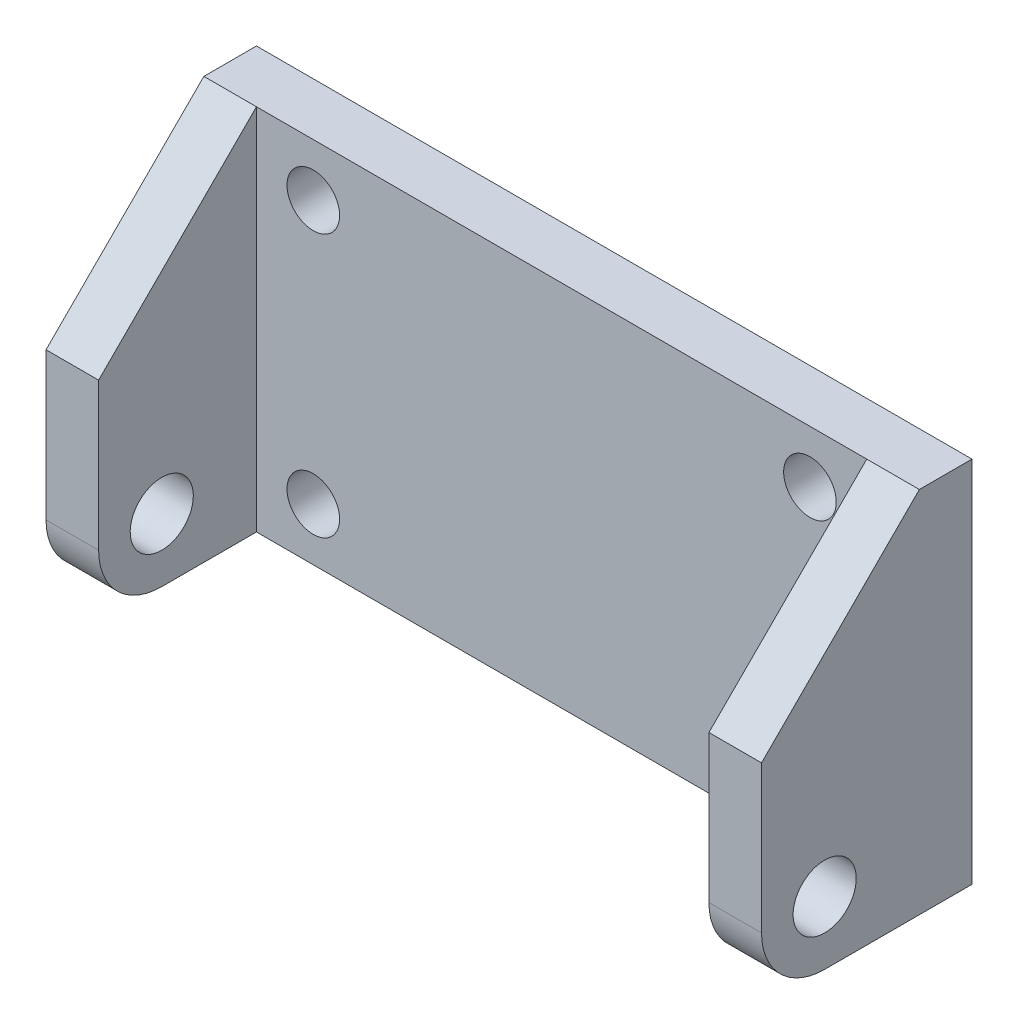
ISO-10303-21;
HEADER;
FILE_DESCRIPTION(('STEP AP214'),'2;1');
FILE_NAME('part.step','',(''),(''),'','','');
FILE_SCHEMA(('AUTOMOTIVE_DESIGN { 1 0 10303 214 1 1 1 1 }'));
ENDSEC;
DATA;
#1=APPLICATION_CONTEXT('core data for automotive mechanical design processes');
#2=APPLICATION_PROTOCOL_DEFINITION('international standard','automotive_design',2000,#1);
#3=PRODUCT_CONTEXT('',#1,'mechanical');
#4=PRODUCT('Part','Part','',(#3));
#5=PRODUCT_RELATED_PRODUCT_CATEGORY('part','',(#4));
#6=PRODUCT_DEFINITION_FORMATION('','',#4);
#7=PRODUCT_DEFINITION_CONTEXT('part definition',#1,'design');
#8=PRODUCT_DEFINITION('design','',#6,#7);
#9=PRODUCT_DEFINITION_SHAPE('','',#8);
#10=(LENGTH_UNIT() NAMED_UNIT(*) SI_UNIT(.MILLI.,.METRE.));
#11=(NAMED_UNIT(*) PLANE_ANGLE_UNIT() SI_UNIT($,.RADIAN.));
#12=(NAMED_UNIT(*) SI_UNIT($,.STERADIAN.) SOLID_ANGLE_UNIT());
#13=UNCERTAINTY_MEASURE_WITH_UNIT(LENGTH_MEASURE(1.E-05),#10,'distance_accuracy_value','');
#14=(GEOMETRIC_REPRESENTATION_CONTEXT(3) GLOBAL_UNCERTAINTY_ASSIGNED_CONTEXT((#13)) GLOBAL_UNIT_ASSIGNED_CONTEXT((#10,
#11,#12)) REPRESENTATION_CONTEXT('',''));
#15=CARTESIAN_POINT('',(0.,0.,0.));
#16=DIRECTION('',(0.,0.,1.));
#17=DIRECTION('',(1.,0.,0.));
#18=AXIS2_PLACEMENT_3D('',#15,#16,#17);
#19=CARTESIAN_POINT('',(0.,0.,2.5));
#20=DIRECTION('',(0.,0.,1.));
#21=DIRECTION('',(1.,0.,0.));
#22=AXIS2_PLACEMENT_3D('',#19,#20,#21);
#23=PLANE('',#22);
#24=CARTESIAN_POINT('',(12.4214285714285,10.3871428571429,2.5));
#25=DIRECTION('',(0.,0.,1.));
#26=DIRECTION('',(1.,0.,0.));
#27=AXIS2_PLACEMENT_3D('',#24,#25,#26);
#28=CIRCLE('',#27,1.25);
#29=CARTESIAN_POINT('',(13.6714285714285,10.3871428571429,2.5));
#30=VERTEX_POINT('',#29);
#31=EDGE_CURVE('E208',#30,#30,#28,.T.);
#32=ORIENTED_EDGE('',*,*,#31,.F.);
#33=EDGE_LOOP('',(#32));
#34=FACE_BOUND('',#33,.T.);
#35=CARTESIAN_POINT('',(-11.1785714285714,-2.11285714285714,2.5));
#36=DIRECTION('',(0.,0.,1.));
#37=DIRECTION('',(1.,0.,0.));
#38=AXIS2_PLACEMENT_3D('',#35,#36,#37);
#39=CIRCLE('',#38,1.25);
#40=CARTESIAN_POINT('',(-9.92857142857143,-2.11285714285714,2.5));
#41=VERTEX_POINT('',#40);
#42=EDGE_CURVE('E220',#41,#41,#39,.T.);
#43=ORIENTED_EDGE('',*,*,#42,.F.);
#44=EDGE_LOOP('',(#43));
#45=FACE_BOUND('',#44,.T.);
#46=CARTESIAN_POINT('',(12.4214285714286,-2.11285714285714,2.5));
#47=DIRECTION('',(0.,0.,1.));
#48=DIRECTION('',(1.,0.,0.));
#49=AXIS2_PLACEMENT_3D('',#46,#47,#48);
#50=CIRCLE('',#49,1.25);
#51=CARTESIAN_POINT('',(13.6714285714286,-2.11285714285714,2.5));
#52=VERTEX_POINT('',#51);
#53=EDGE_CURVE('E214',#52,#52,#50,.T.);
#54=ORIENTED_EDGE('',*,*,#53,.F.);
#55=EDGE_LOOP('',(#54));
#56=FACE_BOUND('',#55,.T.);
#57=CARTESIAN_POINT('',(-11.1785714285715,10.3871428571429,2.5));
#58=DIRECTION('',(0.,0.,1.));
#59=DIRECTION('',(1.,0.,0.));
#60=AXIS2_PLACEMENT_3D('',#57,#58,#59);
#61=CIRCLE('',#60,1.25);
#62=CARTESIAN_POINT('',(-9.92857142857147,10.3871428571429,2.5));
#63=VERTEX_POINT('',#62);
#64=EDGE_CURVE('E202',#63,#63,#61,.T.);
#65=ORIENTED_EDGE('',*,*,#64,.F.);
#66=EDGE_LOOP('',(#65));
#67=FACE_BOUND('',#66,.T.);
#68=DIRECTION('',(1.,0.,0.));
#69=VECTOR('',#68,1.);
#70=CARTESIAN_POINT('',(-16.3785714285714,-4.61285714285714,2.5));
#71=LINE('',#70,#69);
#72=CARTESIAN_POINT('',(-13.8785714285714,-4.61285714285714,2.5));
#73=VERTEX_POINT('',#72);
#74=CARTESIAN_POINT('',(15.1214285714286,-4.61285714285714,2.5));
#75=VERTEX_POINT('',#74);
#76=EDGE_CURVE('E144',#73,#75,#71,.T.);
#77=ORIENTED_EDGE('',*,*,#76,.T.);
#78=DIRECTION('',(0.,-1.,0.));
#79=VECTOR('',#78,1.);
#80=CARTESIAN_POINT('',(15.1214285714286,-4.61285714285714,2.5));
#81=LINE('',#80,#79);
#82=CARTESIAN_POINT('',(15.1214285714286,12.8871428571429,2.5));
#83=VERTEX_POINT('',#82);
#84=EDGE_CURVE('E122',#83,#75,#81,.T.);
#85=ORIENTED_EDGE('',*,*,#84,.F.);
#86=DIRECTION('',(-1.,0.,0.));
#87=VECTOR('',#86,1.);
#88=CARTESIAN_POINT('',(-16.3785714285714,12.8871428571429,2.5));
#89=LINE('',#88,#87);
#90=CARTESIAN_POINT('',(-13.8785714285714,12.8871428571429,2.5));
#91=VERTEX_POINT('',#90);
#92=EDGE_CURVE('E134',#83,#91,#89,.T.);
#93=ORIENTED_EDGE('',*,*,#92,.T.);
#94=DIRECTION('',(0.,1.,0.));
#95=VECTOR('',#94,1.);
#96=CARTESIAN_POINT('',(-13.8785714285714,-4.61285714285714,2.5));
#97=LINE('',#96,#95);
#98=EDGE_CURVE('E195',#73,#91,#97,.T.);
#99=ORIENTED_EDGE('',*,*,#98,.F.);
#100=EDGE_LOOP('',(#77,#85,#93,#99));
#101=FACE_BOUND('',#100,.T.);
#102=ADVANCED_FACE('F33',(#34,#45,#56,#67,#101),#23,.T.);
#103=CARTESIAN_POINT('',(0.,0.,0.));
#104=DIRECTION('',(0.,0.,1.));
#105=DIRECTION('',(1.,0.,0.));
#106=AXIS2_PLACEMENT_3D('',#103,#104,#105);
#107=PLANE('',#106);
#108=DIRECTION('',(0.,-1.,0.));
#109=VECTOR('',#108,1.);
#110=CARTESIAN_POINT('',(-16.3785714285714,12.8871428571429,0.));
#111=LINE('',#110,#109);
#112=CARTESIAN_POINT('',(-16.3785714285714,12.8871428571429,0.));
#113=VERTEX_POINT('',#112);
#114=CARTESIAN_POINT('',(-16.3785714285714,-4.61285714285714,0.));
#115=VERTEX_POINT('',#114);
#116=EDGE_CURVE('E223',#113,#115,#111,.T.);
#117=ORIENTED_EDGE('',*,*,#116,.F.);
#118=DIRECTION('',(-1.,0.,0.));
#119=VECTOR('',#118,1.);
#120=CARTESIAN_POINT('',(-16.3785714285714,12.8871428571429,0.));
#121=LINE('',#120,#119);
#122=CARTESIAN_POINT('',(17.6214285714286,12.8871428571429,0.));
#123=VERTEX_POINT('',#122);
#124=EDGE_CURVE('E226',#123,#113,#121,.T.);
#125=ORIENTED_EDGE('',*,*,#124,.F.);
#126=DIRECTION('',(0.,1.,0.));
#127=VECTOR('',#126,1.);
#128=CARTESIAN_POINT('',(17.6214285714286,12.8871428571429,0.));
#129=LINE('',#128,#127);
#130=CARTESIAN_POINT('',(17.6214285714286,-4.61285714285714,0.));
#131=VERTEX_POINT('',#130);
#132=EDGE_CURVE('E233',#131,#123,#129,.T.);
#133=ORIENTED_EDGE('',*,*,#132,.F.);
#134=DIRECTION('',(1.,0.,0.));
#135=VECTOR('',#134,1.);
#136=CARTESIAN_POINT('',(-16.3785714285714,-4.61285714285714,0.));
#137=LINE('',#136,#135);
#138=EDGE_CURVE('E230',#115,#131,#137,.T.);
#139=ORIENTED_EDGE('',*,*,#138,.F.);
#140=EDGE_LOOP('',(#117,#125,#133,#139));
#141=FACE_BOUND('',#140,.T.);
#142=CARTESIAN_POINT('',(-11.1785714285714,-2.11285714285714,0.));
#143=DIRECTION('',(0.,0.,1.));
#144=DIRECTION('',(1.,0.,0.));
#145=AXIS2_PLACEMENT_3D('',#142,#143,#144);
#146=CIRCLE('',#145,1.25);
#147=CARTESIAN_POINT('',(-9.92857142857143,-2.11285714285714,0.));
#148=VERTEX_POINT('',#147);
#149=EDGE_CURVE('E217',#148,#148,#146,.T.);
#150=ORIENTED_EDGE('',*,*,#149,.T.);
#151=EDGE_LOOP('',(#150));
#152=FACE_BOUND('',#151,.T.);
#153=CARTESIAN_POINT('',(12.4214285714286,-2.11285714285714,0.));
#154=DIRECTION('',(0.,0.,1.));
#155=DIRECTION('',(1.,0.,0.));
#156=AXIS2_PLACEMENT_3D('',#153,#154,#155);
#157=CIRCLE('',#156,1.25);
#158=CARTESIAN_POINT('',(13.6714285714286,-2.11285714285714,0.));
#159=VERTEX_POINT('',#158);
#160=EDGE_CURVE('E211',#159,#159,#157,.T.);
#161=ORIENTED_EDGE('',*,*,#160,.T.);
#162=EDGE_LOOP('',(#161));
#163=FACE_BOUND('',#162,.T.);
#164=CARTESIAN_POINT('',(12.4214285714285,10.3871428571429,0.));
#165=DIRECTION('',(0.,0.,1.));
#166=DIRECTION('',(1.,0.,0.));
#167=AXIS2_PLACEMENT_3D('',#164,#165,#166);
#168=CIRCLE('',#167,1.25);
#169=CARTESIAN_POINT('',(13.6714285714285,10.3871428571429,0.));
#170=VERTEX_POINT('',#169);
#171=EDGE_CURVE('E205',#170,#170,#168,.T.);
#172=ORIENTED_EDGE('',*,*,#171,.T.);
#173=EDGE_LOOP('',(#172));
#174=FACE_BOUND('',#173,.T.);
#175=CARTESIAN_POINT('',(-11.1785714285715,10.3871428571429,0.));
#176=DIRECTION('',(0.,0.,1.));
#177=DIRECTION('',(1.,0.,0.));
#178=AXIS2_PLACEMENT_3D('',#175,#176,#177);
#179=CIRCLE('',#178,1.25);
#180=CARTESIAN_POINT('',(-9.92857142857147,10.3871428571429,0.));
#181=VERTEX_POINT('',#180);
#182=EDGE_CURVE('E189',#181,#181,#179,.T.);
#183=ORIENTED_EDGE('',*,*,#182,.T.);
#184=EDGE_LOOP('',(#183));
#185=FACE_BOUND('',#184,.T.);
#186=ADVANCED_FACE('F257',(#141,#152,#163,#174,#185),#107,.F.);
#187=CARTESIAN_POINT('',(-16.3785714285714,12.8871428571429,2.5));
#188=DIRECTION('',(1.,0.,0.));
#189=DIRECTION('',(0.,1.,0.));
#190=AXIS2_PLACEMENT_3D('',#187,#188,#189);
#191=PLANE('',#190);
#192=CARTESIAN_POINT('',(-16.3785714285714,-1.61285714285714,7.));
#193=DIRECTION('',(1.,0.,0.));
#194=DIRECTION('',(0.,0.,-1.));
#195=AXIS2_PLACEMENT_3D('',#192,#193,#194);
#196=CIRCLE('',#195,1.5);
#197=CARTESIAN_POINT('',(-16.3785714285714,-1.61285714285714,5.5));
#198=VERTEX_POINT('',#197);
#199=EDGE_CURVE('E298',#198,#198,#196,.T.);
#200=ORIENTED_EDGE('',*,*,#199,.T.);
#201=EDGE_LOOP('',(#200));
#202=FACE_BOUND('',#201,.T.);
#203=DIRECTION('',(0.,0.,-1.));
#204=VECTOR('',#203,1.);
#205=CARTESIAN_POINT('',(-16.3785714285714,-4.61285714285714,2.5));
#206=LINE('',#205,#204);
#207=CARTESIAN_POINT('',(-16.3785714285714,-4.61285714285714,7.));
#208=VERTEX_POINT('',#207);
#209=EDGE_CURVE('E243',#208,#115,#206,.T.);
#210=ORIENTED_EDGE('',*,*,#209,.F.);
#211=CARTESIAN_POINT('',(-16.3785714285714,-1.61285714285714,7.));
#212=DIRECTION('',(1.,0.,0.));
#213=DIRECTION('',(0.,1.,0.));
#214=AXIS2_PLACEMENT_3D('',#211,#212,#213);
#215=CIRCLE('',#214,3.);
#216=CARTESIAN_POINT('',(-16.3785714285714,-1.61285714285714,10.));
#217=VERTEX_POINT('',#216);
#218=EDGE_CURVE('E11',#208,#217,#215,.F.);
#219=ORIENTED_EDGE('',*,*,#218,.T.);
#220=DIRECTION('',(0.,-1.,0.));
#221=VECTOR('',#220,1.);
#222=CARTESIAN_POINT('',(-16.3785714285714,-4.61285714285714,10.));
#223=LINE('',#222,#221);
#224=CARTESIAN_POINT('',(-16.3785714285714,5.38714285714287,10.));
#225=VERTEX_POINT('',#224);
#226=EDGE_CURVE('E193',#225,#217,#223,.T.);
#227=ORIENTED_EDGE('',*,*,#226,.F.);
#228=DIRECTION('',(0.,-0.707106781186546,0.707106781186549));
#229=VECTOR('',#228,1.);
#230=CARTESIAN_POINT('',(-16.3785714285714,5.38714285714287,10.));
#231=LINE('',#230,#229);
#232=CARTESIAN_POINT('',(-16.3785714285714,12.8871428571429,2.49999999999998));
#233=VERTEX_POINT('',#232);
#234=EDGE_CURVE('E162',#225,#233,#231,.F.);
#235=ORIENTED_EDGE('',*,*,#234,.T.);
#236=DIRECTION('',(0.,0.,-1.));
#237=VECTOR('',#236,1.);
#238=CARTESIAN_POINT('',(-16.3785714285714,12.8871428571429,2.5));
#239=LINE('',#238,#237);
#240=EDGE_CURVE('E143',#233,#113,#239,.T.);
#241=ORIENTED_EDGE('',*,*,#240,.T.);
#242=ORIENTED_EDGE('',*,*,#116,.T.);
#243=EDGE_LOOP('',(#210,#219,#227,#235,#241,#242));
#244=FACE_BOUND('',#243,.T.);
#245=ADVANCED_FACE('F259',(#202,#244),#191,.F.);
#246=CARTESIAN_POINT('',(-16.3785714285714,-4.61285714285714,2.5));
#247=DIRECTION('',(0.,1.,0.));
#248=DIRECTION('',(0.,0.,1.));
#249=AXIS2_PLACEMENT_3D('',#246,#247,#248);
#250=PLANE('',#249);
#251=DIRECTION('',(0.,0.,-1.));
#252=VECTOR('',#251,1.);
#253=CARTESIAN_POINT('',(17.6214285714286,-4.61285714285714,2.5));
#254=LINE('',#253,#252);
#255=CARTESIAN_POINT('',(17.6214285714286,-4.61285714285714,7.));
#256=VERTEX_POINT('',#255);
#257=EDGE_CURVE('E241',#256,#131,#254,.T.);
#258=ORIENTED_EDGE('',*,*,#257,.F.);
#259=DIRECTION('',(1.,0.,0.));
#260=VECTOR('',#259,1.);
#261=CARTESIAN_POINT('',(15.1214285714286,-4.61285714285714,7.));
#262=LINE('',#261,#260);
#263=CARTESIAN_POINT('',(15.1214285714286,-4.61285714285714,7.));
#264=VERTEX_POINT('',#263);
#265=EDGE_CURVE('E174',#256,#264,#262,.F.);
#266=ORIENTED_EDGE('',*,*,#265,.T.);
#267=DIRECTION('',(0.,0.,-1.));
#268=VECTOR('',#267,1.);
#269=CARTESIAN_POINT('',(15.1214285714286,-4.61285714285714,10.));
#270=LINE('',#269,#268);
#271=EDGE_CURVE('E198',#264,#75,#270,.T.);
#272=ORIENTED_EDGE('',*,*,#271,.T.);
#273=ORIENTED_EDGE('',*,*,#76,.F.);
#274=DIRECTION('',(0.,0.,-1.));
#275=VECTOR('',#274,1.);
#276=CARTESIAN_POINT('',(-13.8785714285714,-4.61285714285714,10.));
#277=LINE('',#276,#275);
#278=CARTESIAN_POINT('',(-13.8785714285714,-4.61285714285714,7.));
#279=VERTEX_POINT('',#278);
#280=EDGE_CURVE('E184',#279,#73,#277,.T.);
#281=ORIENTED_EDGE('',*,*,#280,.F.);
#282=DIRECTION('',(1.,0.,0.));
#283=VECTOR('',#282,1.);
#284=CARTESIAN_POINT('',(-16.3785714285714,-4.61285714285714,7.));
#285=LINE('',#284,#283);
#286=EDGE_CURVE('E172',#279,#208,#285,.F.);
#287=ORIENTED_EDGE('',*,*,#286,.T.);
#288=ORIENTED_EDGE('',*,*,#209,.T.);
#289=ORIENTED_EDGE('',*,*,#138,.T.);
#290=EDGE_LOOP('',(#258,#266,#272,#273,#281,#287,#288,#289));
#291=FACE_BOUND('',#290,.T.);
#292=ADVANCED_FACE('F188',(#291),#250,.F.);
#293=CARTESIAN_POINT('',(17.6214285714286,12.8871428571429,2.5));
#294=DIRECTION('',(-1.,0.,0.));
#295=DIRECTION('',(0.,-1.,0.));
#296=AXIS2_PLACEMENT_3D('',#293,#294,#295);
#297=PLANE('',#296);
#298=CARTESIAN_POINT('',(17.6214285714286,-1.61285714285714,7.));
#299=DIRECTION('',(1.,0.,0.));
#300=DIRECTION('',(0.,0.,-1.));
#301=AXIS2_PLACEMENT_3D('',#298,#299,#300);
#302=CIRCLE('',#301,1.5);
#303=CARTESIAN_POINT('',(17.6214285714286,-1.61285714285714,5.5));
#304=VERTEX_POINT('',#303);
#305=EDGE_CURVE('E300',#304,#304,#302,.T.);
#306=ORIENTED_EDGE('',*,*,#305,.F.);
#307=EDGE_LOOP('',(#306));
#308=FACE_BOUND('',#307,.T.);
#309=DIRECTION('',(0.,1.,0.));
#310=VECTOR('',#309,1.);
#311=CARTESIAN_POINT('',(17.6214285714286,-4.61285714285714,10.));
#312=LINE('',#311,#310);
#313=CARTESIAN_POINT('',(17.6214285714286,-1.61285714285714,10.));
#314=VERTEX_POINT('',#313);
#315=CARTESIAN_POINT('',(17.6214285714286,5.38714285714287,10.));
#316=VERTEX_POINT('',#315);
#317=EDGE_CURVE('E148',#314,#316,#312,.T.);
#318=ORIENTED_EDGE('',*,*,#317,.F.);
#319=CARTESIAN_POINT('',(17.6214285714286,-1.61285714285714,7.));
#320=DIRECTION('',(-1.,0.,0.));
#321=DIRECTION('',(0.,-1.,0.));
#322=AXIS2_PLACEMENT_3D('',#319,#320,#321);
#323=CIRCLE('',#322,3.);
#324=EDGE_CURVE('E170',#314,#256,#323,.F.);
#325=ORIENTED_EDGE('',*,*,#324,.T.);
#326=ORIENTED_EDGE('',*,*,#257,.T.);
#327=ORIENTED_EDGE('',*,*,#132,.T.);
#328=DIRECTION('',(0.,0.,-1.));
#329=VECTOR('',#328,1.);
#330=CARTESIAN_POINT('',(17.6214285714286,12.8871428571429,2.5));
#331=LINE('',#330,#329);
#332=CARTESIAN_POINT('',(17.6214285714286,12.8871428571429,2.49999999999998));
#333=VERTEX_POINT('',#332);
#334=EDGE_CURVE('E239',#333,#123,#331,.T.);
#335=ORIENTED_EDGE('',*,*,#334,.F.);
#336=DIRECTION('',(0.,-0.707106781186546,0.707106781186549));
#337=VECTOR('',#336,1.);
#338=CARTESIAN_POINT('',(17.6214285714286,5.38714285714287,10.));
#339=LINE('',#338,#337);
#340=EDGE_CURVE('E154',#333,#316,#339,.T.);
#341=ORIENTED_EDGE('',*,*,#340,.T.);
#342=EDGE_LOOP('',(#318,#325,#326,#327,#335,#341));
#343=FACE_BOUND('',#342,.T.);
#344=ADVANCED_FACE('F251',(#308,#343),#297,.F.);
#345=CARTESIAN_POINT('',(-16.3785714285714,12.8871428571429,2.5));
#346=DIRECTION('',(0.,-1.,0.));
#347=DIRECTION('',(0.,0.,-1.));
#348=AXIS2_PLACEMENT_3D('',#345,#346,#347);
#349=PLANE('',#348);
#350=ORIENTED_EDGE('',*,*,#92,.F.);
#351=DIRECTION('',(1.,0.,0.));
#352=VECTOR('',#351,1.);
#353=CARTESIAN_POINT('',(17.6214285714286,12.8871428571429,2.49999999999998));
#354=LINE('',#353,#352);
#355=EDGE_CURVE('E136',#83,#333,#354,.T.);
#356=ORIENTED_EDGE('',*,*,#355,.T.);
#357=ORIENTED_EDGE('',*,*,#334,.T.);
#358=ORIENTED_EDGE('',*,*,#124,.T.);
#359=ORIENTED_EDGE('',*,*,#240,.F.);
#360=DIRECTION('',(1.,0.,0.));
#361=VECTOR('',#360,1.);
#362=CARTESIAN_POINT('',(-16.3785714285714,12.8871428571429,2.49999999999998));
#363=LINE('',#362,#361);
#364=EDGE_CURVE('E129',#233,#91,#363,.T.);
#365=ORIENTED_EDGE('',*,*,#364,.T.);
#366=EDGE_LOOP('',(#350,#356,#357,#358,#359,#365));
#367=FACE_BOUND('',#366,.T.);
#368=ADVANCED_FACE('F135',(#367),#349,.F.);
#369=CARTESIAN_POINT('',(-11.1785714285714,-2.11285714285714,2.5));
#370=DIRECTION('',(0.,0.,-1.));
#371=DIRECTION('',(-1.,0.,0.));
#372=AXIS2_PLACEMENT_3D('',#369,#370,#371);
#373=CYLINDRICAL_SURFACE('',#372,1.25);
#374=ORIENTED_EDGE('',*,*,#42,.T.);
#375=EDGE_LOOP('',(#374));
#376=FACE_BOUND('',#375,.T.);
#377=ORIENTED_EDGE('',*,*,#149,.F.);
#378=EDGE_LOOP('',(#377));
#379=FACE_BOUND('',#378,.T.);
#380=ADVANCED_FACE('F282',(#376,#379),#373,.F.);
#381=CARTESIAN_POINT('',(12.4214285714286,-2.11285714285714,2.5));
#382=DIRECTION('',(0.,0.,-1.));
#383=DIRECTION('',(-1.,0.,0.));
#384=AXIS2_PLACEMENT_3D('',#381,#382,#383);
#385=CYLINDRICAL_SURFACE('',#384,1.25);
#386=ORIENTED_EDGE('',*,*,#53,.T.);
#387=EDGE_LOOP('',(#386));
#388=FACE_BOUND('',#387,.T.);
#389=ORIENTED_EDGE('',*,*,#160,.F.);
#390=EDGE_LOOP('',(#389));
#391=FACE_BOUND('',#390,.T.);
#392=ADVANCED_FACE('F337',(#388,#391),#385,.F.);
#393=CARTESIAN_POINT('',(12.4214285714285,10.3871428571429,2.5));
#394=DIRECTION('',(0.,0.,-1.));
#395=DIRECTION('',(-1.,0.,0.));
#396=AXIS2_PLACEMENT_3D('',#393,#394,#395);
#397=CYLINDRICAL_SURFACE('',#396,1.25);
#398=ORIENTED_EDGE('',*,*,#31,.T.);
#399=EDGE_LOOP('',(#398));
#400=FACE_BOUND('',#399,.T.);
#401=ORIENTED_EDGE('',*,*,#171,.F.);
#402=EDGE_LOOP('',(#401));
#403=FACE_BOUND('',#402,.T.);
#404=ADVANCED_FACE('F334',(#400,#403),#397,.F.);
#405=CARTESIAN_POINT('',(-11.1785714285715,10.3871428571429,2.5));
#406=DIRECTION('',(0.,0.,-1.));
#407=DIRECTION('',(-1.,0.,0.));
#408=AXIS2_PLACEMENT_3D('',#405,#406,#407);
#409=CYLINDRICAL_SURFACE('',#408,1.25);
#410=ORIENTED_EDGE('',*,*,#64,.T.);
#411=EDGE_LOOP('',(#410));
#412=FACE_BOUND('',#411,.T.);
#413=ORIENTED_EDGE('',*,*,#182,.F.);
#414=EDGE_LOOP('',(#413));
#415=FACE_BOUND('',#414,.T.);
#416=ADVANCED_FACE('F331',(#412,#415),#409,.F.);
#417=CARTESIAN_POINT('',(-13.8785714285714,-4.61285714285714,10.));
#418=DIRECTION('',(-1.,0.,0.));
#419=DIRECTION('',(0.,-1.,0.));
#420=AXIS2_PLACEMENT_3D('',#417,#418,#419);
#421=PLANE('',#420);
#422=CARTESIAN_POINT('',(-13.8785714285714,-1.61285714285714,7.));
#423=DIRECTION('',(-1.,0.,0.));
#424=DIRECTION('',(0.,-1.,0.));
#425=AXIS2_PLACEMENT_3D('',#422,#423,#424);
#426=CIRCLE('',#425,1.5);
#427=CARTESIAN_POINT('',(-13.8785714285714,-3.11285714285714,7.));
#428=VERTEX_POINT('',#427);
#429=EDGE_CURVE('E149',#428,#428,#426,.T.);
#430=ORIENTED_EDGE('',*,*,#429,.T.);
#431=EDGE_LOOP('',(#430));
#432=FACE_BOUND('',#431,.T.);
#433=DIRECTION('',(0.,1.,0.));
#434=VECTOR('',#433,1.);
#435=CARTESIAN_POINT('',(-13.8785714285714,-4.61285714285714,10.));
#436=LINE('',#435,#434);
#437=CARTESIAN_POINT('',(-13.8785714285714,-1.61285714285714,10.));
#438=VERTEX_POINT('',#437);
#439=CARTESIAN_POINT('',(-13.8785714285714,5.38714285714287,10.));
#440=VERTEX_POINT('',#439);
#441=EDGE_CURVE('E185',#438,#440,#436,.T.);
#442=ORIENTED_EDGE('',*,*,#441,.F.);
#443=CARTESIAN_POINT('',(-13.8785714285714,-1.61285714285714,7.));
#444=DIRECTION('',(-1.,0.,0.));
#445=DIRECTION('',(0.,-1.,0.));
#446=AXIS2_PLACEMENT_3D('',#443,#444,#445);
#447=CIRCLE('',#446,3.);
#448=EDGE_CURVE('E42',#438,#279,#447,.F.);
#449=ORIENTED_EDGE('',*,*,#448,.T.);
#450=ORIENTED_EDGE('',*,*,#280,.T.);
#451=ORIENTED_EDGE('',*,*,#98,.T.);
#452=DIRECTION('',(0.,0.707106781186546,-0.707106781186549));
#453=VECTOR('',#452,1.);
#454=CARTESIAN_POINT('',(-13.8785714285714,5.38714285714287,10.));
#455=LINE('',#454,#453);
#456=EDGE_CURVE('E164',#91,#440,#455,.F.);
#457=ORIENTED_EDGE('',*,*,#456,.T.);
#458=EDGE_LOOP('',(#442,#449,#450,#451,#457));
#459=FACE_BOUND('',#458,.T.);
#460=ADVANCED_FACE('F183',(#432,#459),#421,.F.);
#461=CARTESIAN_POINT('',(0.,0.,10.));
#462=DIRECTION('',(0.,0.,-1.));
#463=DIRECTION('',(-1.,0.,0.));
#464=AXIS2_PLACEMENT_3D('',#461,#462,#463);
#465=PLANE('',#464);
#466=ORIENTED_EDGE('',*,*,#226,.T.);
#467=DIRECTION('',(1.,0.,0.));
#468=VECTOR('',#467,1.);
#469=CARTESIAN_POINT('',(0.,-1.61285714285714,10.));
#470=LINE('',#469,#468);
#471=EDGE_CURVE('E178',#217,#438,#470,.T.);
#472=ORIENTED_EDGE('',*,*,#471,.T.);
#473=ORIENTED_EDGE('',*,*,#441,.T.);
#474=DIRECTION('',(-1.,0.,0.));
#475=VECTOR('',#474,1.);
#476=CARTESIAN_POINT('',(0.,5.38714285714287,10.));
#477=LINE('',#476,#475);
#478=EDGE_CURVE('E156',#440,#225,#477,.T.);
#479=ORIENTED_EDGE('',*,*,#478,.T.);
#480=EDGE_LOOP('',(#466,#472,#473,#479));
#481=FACE_BOUND('',#480,.T.);
#482=ADVANCED_FACE('F192',(#481),#465,.F.);
#483=CARTESIAN_POINT('',(15.1214285714286,-4.61285714285714,10.));
#484=DIRECTION('',(1.,0.,0.));
#485=DIRECTION('',(0.,1.,0.));
#486=AXIS2_PLACEMENT_3D('',#483,#484,#485);
#487=PLANE('',#486);
#488=CARTESIAN_POINT('',(15.1214285714286,-1.61285714285714,7.));
#489=DIRECTION('',(1.,0.,0.));
#490=DIRECTION('',(0.,1.,0.));
#491=AXIS2_PLACEMENT_3D('',#488,#489,#490);
#492=CIRCLE('',#491,1.5);
#493=CARTESIAN_POINT('',(15.1214285714286,-0.112857142857139,7.));
#494=VERTEX_POINT('',#493);
#495=EDGE_CURVE('E37',#494,#494,#492,.T.);
#496=ORIENTED_EDGE('',*,*,#495,.T.);
#497=EDGE_LOOP('',(#496));
#498=FACE_BOUND('',#497,.T.);
#499=ORIENTED_EDGE('',*,*,#271,.F.);
#500=CARTESIAN_POINT('',(15.1214285714286,-1.61285714285714,7.));
#501=DIRECTION('',(1.,0.,0.));
#502=DIRECTION('',(0.,1.,0.));
#503=AXIS2_PLACEMENT_3D('',#500,#501,#502);
#504=CIRCLE('',#503,3.);
#505=CARTESIAN_POINT('',(15.1214285714286,-1.61285714285714,10.));
#506=VERTEX_POINT('',#505);
#507=EDGE_CURVE('E176',#264,#506,#504,.F.);
#508=ORIENTED_EDGE('',*,*,#507,.T.);
#509=DIRECTION('',(0.,-1.,0.));
#510=VECTOR('',#509,1.);
#511=CARTESIAN_POINT('',(15.1214285714286,-4.61285714285714,10.));
#512=LINE('',#511,#510);
#513=CARTESIAN_POINT('',(15.1214285714286,5.38714285714287,10.));
#514=VERTEX_POINT('',#513);
#515=EDGE_CURVE('E124',#514,#506,#512,.T.);
#516=ORIENTED_EDGE('',*,*,#515,.F.);
#517=DIRECTION('',(0.,0.707106781186546,-0.707106781186549));
#518=VECTOR('',#517,1.);
#519=CARTESIAN_POINT('',(15.1214285714286,5.38714285714287,10.));
#520=LINE('',#519,#518);
#521=EDGE_CURVE('E117',#514,#83,#520,.T.);
#522=ORIENTED_EDGE('',*,*,#521,.T.);
#523=ORIENTED_EDGE('',*,*,#84,.T.);
#524=EDGE_LOOP('',(#499,#508,#516,#522,#523));
#525=FACE_BOUND('',#524,.T.);
#526=ADVANCED_FACE('F120',(#498,#525),#487,.F.);
#527=CARTESIAN_POINT('',(0.,0.,10.));
#528=DIRECTION('',(0.,0.,1.));
#529=DIRECTION('',(1.,0.,0.));
#530=AXIS2_PLACEMENT_3D('',#527,#528,#529);
#531=PLANE('',#530);
#532=ORIENTED_EDGE('',*,*,#515,.T.);
#533=DIRECTION('',(1.,0.,0.));
#534=VECTOR('',#533,1.);
#535=CARTESIAN_POINT('',(17.6214285714286,-1.61285714285714,10.));
#536=LINE('',#535,#534);
#537=EDGE_CURVE('E167',#506,#314,#536,.T.);
#538=ORIENTED_EDGE('',*,*,#537,.T.);
#539=ORIENTED_EDGE('',*,*,#317,.T.);
#540=DIRECTION('',(-1.,0.,0.));
#541=VECTOR('',#540,1.);
#542=CARTESIAN_POINT('',(15.1214285714286,5.38714285714287,10.));
#543=LINE('',#542,#541);
#544=EDGE_CURVE('E130',#316,#514,#543,.T.);
#545=ORIENTED_EDGE('',*,*,#544,.T.);
#546=EDGE_LOOP('',(#532,#538,#539,#545));
#547=FACE_BOUND('',#546,.T.);
#548=ADVANCED_FACE('F246',(#547),#531,.T.);
#549=CARTESIAN_POINT('',(0.,5.38714285714287,10.));
#550=DIRECTION('',(0.,0.707106781186549,0.707106781186546));
#551=DIRECTION('',(1.,0.,0.));
#552=AXIS2_PLACEMENT_3D('',#549,#550,#551);
#553=PLANE('',#552);
#554=ORIENTED_EDGE('',*,*,#340,.F.);
#555=ORIENTED_EDGE('',*,*,#355,.F.);
#556=ORIENTED_EDGE('',*,*,#521,.F.);
#557=ORIENTED_EDGE('',*,*,#544,.F.);
#558=EDGE_LOOP('',(#554,#555,#556,#557));
#559=FACE_BOUND('',#558,.T.);
#560=ADVANCED_FACE('F152',(#559),#553,.T.);
#561=CARTESIAN_POINT('',(0.,5.38714285714287,10.));
#562=DIRECTION('',(0.,-0.707106781186549,-0.707106781186546));
#563=DIRECTION('',(-1.,0.,0.));
#564=AXIS2_PLACEMENT_3D('',#561,#562,#563);
#565=PLANE('',#564);
#566=ORIENTED_EDGE('',*,*,#456,.F.);
#567=ORIENTED_EDGE('',*,*,#364,.F.);
#568=ORIENTED_EDGE('',*,*,#234,.F.);
#569=ORIENTED_EDGE('',*,*,#478,.F.);
#570=EDGE_LOOP('',(#566,#567,#568,#569));
#571=FACE_BOUND('',#570,.T.);
#572=ADVANCED_FACE('F262',(#571),#565,.F.);
#573=CARTESIAN_POINT('',(0.,-1.61285714285714,7.));
#574=DIRECTION('',(-1.,0.,0.));
#575=DIRECTION('',(0.,0.,1.));
#576=AXIS2_PLACEMENT_3D('',#573,#574,#575);
#577=CYLINDRICAL_SURFACE('',#576,3.);
#578=ORIENTED_EDGE('',*,*,#507,.F.);
#579=ORIENTED_EDGE('',*,*,#265,.F.);
#580=ORIENTED_EDGE('',*,*,#324,.F.);
#581=ORIENTED_EDGE('',*,*,#537,.F.);
#582=EDGE_LOOP('',(#578,#579,#580,#581));
#583=FACE_BOUND('',#582,.T.);
#584=ADVANCED_FACE('F264',(#583),#577,.T.);
#585=CARTESIAN_POINT('',(0.,-1.61285714285714,7.));
#586=DIRECTION('',(1.,0.,0.));
#587=DIRECTION('',(0.,0.,-1.));
#588=AXIS2_PLACEMENT_3D('',#585,#586,#587);
#589=CYLINDRICAL_SURFACE('',#588,3.);
#590=ORIENTED_EDGE('',*,*,#218,.F.);
#591=ORIENTED_EDGE('',*,*,#286,.F.);
#592=ORIENTED_EDGE('',*,*,#448,.F.);
#593=ORIENTED_EDGE('',*,*,#471,.F.);
#594=EDGE_LOOP('',(#590,#591,#592,#593));
#595=FACE_BOUND('',#594,.T.);
#596=ADVANCED_FACE('F35',(#595),#589,.T.);
#597=CARTESIAN_POINT('',(-16.3785714285714,-1.61285714285714,7.));
#598=DIRECTION('',(1.,0.,0.));
#599=DIRECTION('',(0.,0.,-1.));
#600=AXIS2_PLACEMENT_3D('',#597,#598,#599);
#601=CYLINDRICAL_SURFACE('',#600,1.5);
#602=ORIENTED_EDGE('',*,*,#305,.T.);
#603=EDGE_LOOP('',(#602));
#604=FACE_BOUND('',#603,.T.);
#605=ORIENTED_EDGE('',*,*,#495,.F.);
#606=EDGE_LOOP('',(#605));
#607=FACE_BOUND('',#606,.T.);
#608=ADVANCED_FACE('F315',(#604,#607),#601,.F.);
#609=ORIENTED_EDGE('',*,*,#199,.F.);
#610=EDGE_LOOP('',(#609));
#611=FACE_BOUND('',#610,.T.);
#612=ORIENTED_EDGE('',*,*,#429,.F.);
#613=EDGE_LOOP('',(#612));
#614=FACE_BOUND('',#613,.T.);
#615=ADVANCED_FACE('F313',(#611,#614),#601,.F.);
#616=CLOSED_SHELL('',(#102,#186,#245,#292,#344,#368,#380,#392,#404,#416,#460,#482,#526,#548,
#560,#572,#584,#596,#608,#615));
#617=MANIFOLD_SOLID_BREP('B2',#616);
#618=ADVANCED_BREP_SHAPE_REPRESENTATION('',(#18,#617),#14);
#619=SHAPE_DEFINITION_REPRESENTATION(#9,#618);
ENDSEC;
END-ISO-10303-21;
